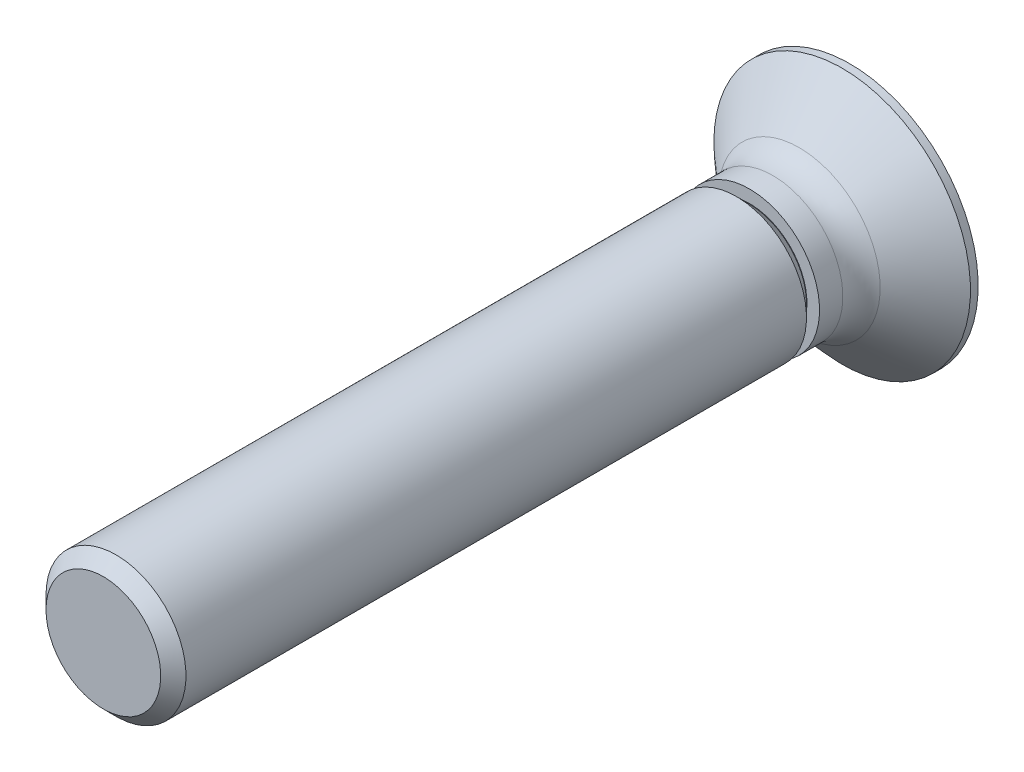
ISO-10303-21;
HEADER;
FILE_DESCRIPTION(('STEP AP214'),'2;1');
FILE_NAME('part.step','',(''),(''),'','','');
FILE_SCHEMA(('AUTOMOTIVE_DESIGN { 1 0 10303 214 1 1 1 1 }'));
ENDSEC;
DATA;
#1=APPLICATION_CONTEXT('core data for automotive mechanical design processes');
#2=APPLICATION_PROTOCOL_DEFINITION('international standard','automotive_design',2000,#1);
#3=PRODUCT_CONTEXT('',#1,'mechanical');
#4=PRODUCT('Part','Part','',(#3));
#5=PRODUCT_RELATED_PRODUCT_CATEGORY('part','',(#4));
#6=PRODUCT_DEFINITION_FORMATION('','',#4);
#7=PRODUCT_DEFINITION_CONTEXT('part definition',#1,'design');
#8=PRODUCT_DEFINITION('design','',#6,#7);
#9=PRODUCT_DEFINITION_SHAPE('','',#8);
#10=(LENGTH_UNIT() NAMED_UNIT(*) SI_UNIT(.MILLI.,.METRE.));
#11=(NAMED_UNIT(*) PLANE_ANGLE_UNIT() SI_UNIT($,.RADIAN.));
#12=(NAMED_UNIT(*) SI_UNIT($,.STERADIAN.) SOLID_ANGLE_UNIT());
#13=UNCERTAINTY_MEASURE_WITH_UNIT(LENGTH_MEASURE(1.E-05),#10,'distance_accuracy_value','');
#14=(GEOMETRIC_REPRESENTATION_CONTEXT(3) GLOBAL_UNCERTAINTY_ASSIGNED_CONTEXT((#13)) GLOBAL_UNIT_ASSIGNED_CONTEXT((#10,
#11,#12)) REPRESENTATION_CONTEXT('',''));
#15=CARTESIAN_POINT('',(0.,0.,0.));
#16=DIRECTION('',(0.,0.,1.));
#17=DIRECTION('',(1.,0.,0.));
#18=AXIS2_PLACEMENT_3D('',#15,#16,#17);
#19=CARTESIAN_POINT('',(0.,2.75,0.));
#20=DIRECTION('',(0.,0.,1.));
#21=DIRECTION('',(1.,0.,0.));
#22=AXIS2_PLACEMENT_3D('',#19,#20,#21);
#23=PLANE('',#22);
#24=CARTESIAN_POINT('',(0.,0.,0.));
#25=DIRECTION('',(0.,0.,-1.));
#26=DIRECTION('',(-1.,0.,0.));
#27=AXIS2_PLACEMENT_3D('',#24,#25,#26);
#28=CIRCLE('',#27,2.75);
#29=CARTESIAN_POINT('',(-2.75,0.,0.));
#30=VERTEX_POINT('',#29);
#31=EDGE_CURVE('E236',#30,#30,#28,.T.);
#32=ORIENTED_EDGE('',*,*,#31,.T.);
#33=EDGE_LOOP('',(#32));
#34=FACE_BOUND('',#33,.T.);
#35=DIRECTION('',(0.422618261740699,0.90630778703665,0.));
#36=VECTOR('',#35,1.);
#37=CARTESIAN_POINT('',(0.266666666666666,-1.6,0.));
#38=LINE('',#37,#36);
#39=CARTESIAN_POINT('',(0.266666666666666,-1.6,0.));
#40=VERTEX_POINT('',#39);
#41=CARTESIAN_POINT('',(0.690686510489199,-0.690686510489199,0.));
#42=VERTEX_POINT('',#41);
#43=EDGE_CURVE('E31',#40,#42,#38,.T.);
#44=ORIENTED_EDGE('',*,*,#43,.T.);
#45=DIRECTION('',(0.90630778703665,0.422618261740699,0.));
#46=VECTOR('',#45,1.);
#47=CARTESIAN_POINT('',(0.690686510489199,-0.690686510489199,0.));
#48=LINE('',#47,#46);
#49=CARTESIAN_POINT('',(1.6,-0.266666666666667,0.));
#50=VERTEX_POINT('',#49);
#51=EDGE_CURVE('E162',#42,#50,#48,.T.);
#52=ORIENTED_EDGE('',*,*,#51,.T.);
#53=DIRECTION('',(0.,1.,0.));
#54=VECTOR('',#53,1.);
#55=CARTESIAN_POINT('',(1.6,-0.266666666666667,0.));
#56=LINE('',#55,#54);
#57=CARTESIAN_POINT('',(1.6,0.266666666666666,0.));
#58=VERTEX_POINT('',#57);
#59=EDGE_CURVE('E158',#50,#58,#56,.T.);
#60=ORIENTED_EDGE('',*,*,#59,.T.);
#61=DIRECTION('',(-0.90630778703665,0.422618261740699,0.));
#62=VECTOR('',#61,1.);
#63=CARTESIAN_POINT('',(1.6,0.266666666666666,0.));
#64=LINE('',#63,#62);
#65=CARTESIAN_POINT('',(0.690686510489199,0.690686510489198,0.));
#66=VERTEX_POINT('',#65);
#67=EDGE_CURVE('E154',#58,#66,#64,.T.);
#68=ORIENTED_EDGE('',*,*,#67,.T.);
#69=DIRECTION('',(-0.422618261740699,0.90630778703665,0.));
#70=VECTOR('',#69,1.);
#71=CARTESIAN_POINT('',(0.690686510489199,0.690686510489198,0.));
#72=LINE('',#71,#70);
#73=CARTESIAN_POINT('',(0.266666666666667,1.6,0.));
#74=VERTEX_POINT('',#73);
#75=EDGE_CURVE('E150',#66,#74,#72,.T.);
#76=ORIENTED_EDGE('',*,*,#75,.T.);
#77=DIRECTION('',(-1.,0.,0.));
#78=VECTOR('',#77,1.);
#79=CARTESIAN_POINT('',(0.266666666666667,1.6,0.));
#80=LINE('',#79,#78);
#81=CARTESIAN_POINT('',(-0.266666666666666,1.6,0.));
#82=VERTEX_POINT('',#81);
#83=EDGE_CURVE('E146',#74,#82,#80,.T.);
#84=ORIENTED_EDGE('',*,*,#83,.T.);
#85=DIRECTION('',(-0.422618261740699,-0.90630778703665,0.));
#86=VECTOR('',#85,1.);
#87=CARTESIAN_POINT('',(-0.266666666666666,1.6,0.));
#88=LINE('',#87,#86);
#89=CARTESIAN_POINT('',(-0.690686510489197,0.690686510489199,0.));
#90=VERTEX_POINT('',#89);
#91=EDGE_CURVE('E142',#82,#90,#88,.T.);
#92=ORIENTED_EDGE('',*,*,#91,.T.);
#93=DIRECTION('',(-0.90630778703665,-0.422618261740699,0.));
#94=VECTOR('',#93,1.);
#95=CARTESIAN_POINT('',(-0.690686510489197,0.690686510489199,0.));
#96=LINE('',#95,#94);
#97=CARTESIAN_POINT('',(-1.6,0.266666666666667,0.));
#98=VERTEX_POINT('',#97);
#99=EDGE_CURVE('E138',#90,#98,#96,.T.);
#100=ORIENTED_EDGE('',*,*,#99,.T.);
#101=DIRECTION('',(0.,-1.,0.));
#102=VECTOR('',#101,1.);
#103=CARTESIAN_POINT('',(-1.6,0.266666666666667,0.));
#104=LINE('',#103,#102);
#105=CARTESIAN_POINT('',(-1.6,-0.266666666666666,0.));
#106=VERTEX_POINT('',#105);
#107=EDGE_CURVE('E133',#98,#106,#104,.T.);
#108=ORIENTED_EDGE('',*,*,#107,.T.);
#109=DIRECTION('',(0.90630778703665,-0.422618261740699,0.));
#110=VECTOR('',#109,1.);
#111=CARTESIAN_POINT('',(-1.6,-0.266666666666666,0.));
#112=LINE('',#111,#110);
#113=CARTESIAN_POINT('',(-0.690686510489199,-0.690686510489198,0.));
#114=VERTEX_POINT('',#113);
#115=EDGE_CURVE('E127',#106,#114,#112,.T.);
#116=ORIENTED_EDGE('',*,*,#115,.T.);
#117=DIRECTION('',(0.4226182617407,-0.90630778703665,0.));
#118=VECTOR('',#117,1.);
#119=CARTESIAN_POINT('',(-0.690686510489199,-0.690686510489198,0.));
#120=LINE('',#119,#118);
#121=CARTESIAN_POINT('',(-0.266666666666666,-1.6,0.));
#122=VERTEX_POINT('',#121);
#123=EDGE_CURVE('E110',#114,#122,#120,.T.);
#124=ORIENTED_EDGE('',*,*,#123,.T.);
#125=DIRECTION('',(1.,0.,0.));
#126=VECTOR('',#125,1.);
#127=CARTESIAN_POINT('',(-0.266666666666666,-1.6,0.));
#128=LINE('',#127,#126);
#129=EDGE_CURVE('E119',#122,#40,#128,.T.);
#130=ORIENTED_EDGE('',*,*,#129,.T.);
#131=EDGE_LOOP('',(#44,#52,#60,#68,#76,#84,#92,#100,#108,#116,#124,#130));
#132=FACE_BOUND('',#131,.T.);
#133=ADVANCED_FACE('F15',(#34,#132),#23,.F.);
#134=CARTESIAN_POINT('',(0.,0.,16.));
#135=DIRECTION('',(0.,0.,-1.));
#136=DIRECTION('',(-1.,0.,0.));
#137=AXIS2_PLACEMENT_3D('',#134,#135,#136);
#138=PLANE('',#137);
#139=CARTESIAN_POINT('',(0.,0.,16.));
#140=DIRECTION('',(0.,0.,-1.));
#141=DIRECTION('',(-1.,0.,0.));
#142=AXIS2_PLACEMENT_3D('',#139,#140,#141);
#143=CIRCLE('',#142,1.229375);
#144=CARTESIAN_POINT('',(-1.229375,0.,16.));
#145=VERTEX_POINT('',#144);
#146=EDGE_CURVE('E10',#145,#145,#143,.T.);
#147=ORIENTED_EDGE('',*,*,#146,.F.);
#148=EDGE_LOOP('',(#147));
#149=FACE_BOUND('',#148,.T.);
#150=ADVANCED_FACE('F17',(#149),#138,.F.);
#151=CARTESIAN_POINT('',(0.,0.,16.));
#152=DIRECTION('',(0.,0.,-1.));
#153=DIRECTION('',(-1.,0.,0.));
#154=AXIS2_PLACEMENT_3D('',#151,#152,#153);
#155=CONICAL_SURFACE('',#154,1.229375,0.785398163397449);
#156=CARTESIAN_POINT('',(0.,0.,15.729375));
#157=DIRECTION('',(0.,0.,-1.));
#158=DIRECTION('',(-1.,0.,0.));
#159=AXIS2_PLACEMENT_3D('',#156,#157,#158);
#160=CIRCLE('',#159,1.5);
#161=CARTESIAN_POINT('',(-1.5,0.,15.729375));
#162=VERTEX_POINT('',#161);
#163=EDGE_CURVE('E24',#162,#162,#160,.T.);
#164=ORIENTED_EDGE('',*,*,#163,.F.);
#165=EDGE_LOOP('',(#164));
#166=FACE_BOUND('',#165,.T.);
#167=ORIENTED_EDGE('',*,*,#146,.T.);
#168=EDGE_LOOP('',(#167));
#169=FACE_BOUND('',#168,.T.);
#170=ADVANCED_FACE('F276',(#166,#169),#155,.T.);
#171=CARTESIAN_POINT('',(0.,0.,0.));
#172=DIRECTION('',(0.,0.,-1.));
#173=DIRECTION('',(-1.,0.,0.));
#174=AXIS2_PLACEMENT_3D('',#171,#172,#173);
#175=CYLINDRICAL_SURFACE('',#174,1.5);
#176=CARTESIAN_POINT('',(0.,0.,2.430625));
#177=DIRECTION('',(0.,0.,-1.));
#178=DIRECTION('',(-1.,0.,0.));
#179=AXIS2_PLACEMENT_3D('',#176,#177,#178);
#180=CIRCLE('',#179,1.5);
#181=CARTESIAN_POINT('',(-1.5,0.,2.430625));
#182=VERTEX_POINT('',#181);
#183=EDGE_CURVE('E264',#182,#182,#180,.T.);
#184=ORIENTED_EDGE('',*,*,#183,.F.);
#185=EDGE_LOOP('',(#184));
#186=FACE_BOUND('',#185,.T.);
#187=ORIENTED_EDGE('',*,*,#163,.T.);
#188=EDGE_LOOP('',(#187));
#189=FACE_BOUND('',#188,.T.);
#190=ADVANCED_FACE('F274',(#186,#189),#175,.T.);
#191=CARTESIAN_POINT('',(0.,0.,2.430625));
#192=DIRECTION('',(0.,0.,1.));
#193=DIRECTION('',(1.,0.,0.));
#194=AXIS2_PLACEMENT_3D('',#191,#192,#193);
#195=CONICAL_SURFACE('',#194,1.5,0.785398163397448);
#196=CARTESIAN_POINT('',(0.,0.,2.16));
#197=DIRECTION('',(0.,0.,-1.));
#198=DIRECTION('',(-1.,0.,0.));
#199=AXIS2_PLACEMENT_3D('',#196,#197,#198);
#200=CIRCLE('',#199,1.229375);
#201=CARTESIAN_POINT('',(-1.229375,0.,2.16));
#202=VERTEX_POINT('',#201);
#203=EDGE_CURVE('E260',#202,#202,#200,.T.);
#204=ORIENTED_EDGE('',*,*,#203,.F.);
#205=EDGE_LOOP('',(#204));
#206=FACE_BOUND('',#205,.T.);
#207=ORIENTED_EDGE('',*,*,#183,.T.);
#208=EDGE_LOOP('',(#207));
#209=FACE_BOUND('',#208,.T.);
#210=ADVANCED_FACE('F317',(#206,#209),#195,.T.);
#211=CARTESIAN_POINT('',(0.,0.,0.));
#212=DIRECTION('',(0.,0.,-1.));
#213=DIRECTION('',(-1.,0.,0.));
#214=AXIS2_PLACEMENT_3D('',#211,#212,#213);
#215=CYLINDRICAL_SURFACE('',#214,1.229375);
#216=CARTESIAN_POINT('',(0.,0.,2.15));
#217=DIRECTION('',(0.,0.,-1.));
#218=DIRECTION('',(-1.,0.,0.));
#219=AXIS2_PLACEMENT_3D('',#216,#217,#218);
#220=CIRCLE('',#219,1.229375);
#221=CARTESIAN_POINT('',(-1.229375,0.,2.15));
#222=VERTEX_POINT('',#221);
#223=EDGE_CURVE('E256',#222,#222,#220,.T.);
#224=ORIENTED_EDGE('',*,*,#223,.F.);
#225=EDGE_LOOP('',(#224));
#226=FACE_BOUND('',#225,.T.);
#227=ORIENTED_EDGE('',*,*,#203,.T.);
#228=EDGE_LOOP('',(#227));
#229=FACE_BOUND('',#228,.T.);
#230=ADVANCED_FACE('F313',(#226,#229),#215,.T.);
#231=CARTESIAN_POINT('',(0.,1.229375,2.15));
#232=DIRECTION('',(0.,0.,-1.));
#233=DIRECTION('',(-1.,0.,0.));
#234=AXIS2_PLACEMENT_3D('',#231,#232,#233);
#235=PLANE('',#234);
#236=CARTESIAN_POINT('',(0.,0.,2.15));
#237=DIRECTION('',(0.,0.,-1.));
#238=DIRECTION('',(-1.,0.,0.));
#239=AXIS2_PLACEMENT_3D('',#236,#237,#238);
#240=CIRCLE('',#239,1.5);
#241=CARTESIAN_POINT('',(-1.5,0.,2.15));
#242=VERTEX_POINT('',#241);
#243=EDGE_CURVE('E252',#242,#242,#240,.T.);
#244=ORIENTED_EDGE('',*,*,#243,.F.);
#245=EDGE_LOOP('',(#244));
#246=FACE_BOUND('',#245,.T.);
#247=ORIENTED_EDGE('',*,*,#223,.T.);
#248=EDGE_LOOP('',(#247));
#249=FACE_BOUND('',#248,.T.);
#250=ADVANCED_FACE('F309',(#246,#249),#235,.F.);
#251=CARTESIAN_POINT('',(0.,0.,0.));
#252=DIRECTION('',(0.,0.,-1.));
#253=DIRECTION('',(-1.,0.,0.));
#254=AXIS2_PLACEMENT_3D('',#251,#252,#253);
#255=CYLINDRICAL_SURFACE('',#254,1.5);
#256=CARTESIAN_POINT('',(0.,0.,1.65));
#257=DIRECTION('',(0.,0.,-1.));
#258=DIRECTION('',(-1.,0.,0.));
#259=AXIS2_PLACEMENT_3D('',#256,#257,#258);
#260=CIRCLE('',#259,1.5);
#261=CARTESIAN_POINT('',(-1.5,0.,1.65));
#262=VERTEX_POINT('',#261);
#263=EDGE_CURVE('E248',#262,#262,#260,.T.);
#264=ORIENTED_EDGE('',*,*,#263,.F.);
#265=EDGE_LOOP('',(#264));
#266=FACE_BOUND('',#265,.T.);
#267=ORIENTED_EDGE('',*,*,#243,.T.);
#268=EDGE_LOOP('',(#267));
#269=FACE_BOUND('',#268,.T.);
#270=ADVANCED_FACE('F305',(#266,#269),#255,.T.);
#271=CARTESIAN_POINT('',(0.,0.,1.65));
#272=DIRECTION('',(0.,0.,-1.));
#273=DIRECTION('',(-1.,0.,0.));
#274=AXIS2_PLACEMENT_3D('',#271,#272,#273);
#275=TOROIDAL_SURFACE('',#274,2.3,0.8);
#276=ORIENTED_EDGE('',*,*,#263,.T.);
#277=EDGE_LOOP('',(#276));
#278=FACE_BOUND('',#277,.T.);
#279=CARTESIAN_POINT('',(0.,0.,1.08431457505076));
#280=DIRECTION('',(0.,0.,-1.));
#281=DIRECTION('',(-1.,0.,0.));
#282=AXIS2_PLACEMENT_3D('',#279,#280,#281);
#283=CIRCLE('',#282,1.73431457505076);
#284=CARTESIAN_POINT('',(-1.73431457505076,0.,1.08431457505076));
#285=VERTEX_POINT('',#284);
#286=EDGE_CURVE('E244',#285,#285,#283,.T.);
#287=ORIENTED_EDGE('',*,*,#286,.F.);
#288=EDGE_LOOP('',(#287));
#289=FACE_BOUND('',#288,.T.);
#290=ADVANCED_FACE('F301',(#278,#289),#275,.F.);
#291=CARTESIAN_POINT('',(0.,0.,1.08431457505076));
#292=DIRECTION('',(0.,0.,-1.));
#293=DIRECTION('',(-1.,0.,0.));
#294=AXIS2_PLACEMENT_3D('',#291,#292,#293);
#295=CONICAL_SURFACE('',#294,1.73431457505076,0.835161102643237);
#296=CARTESIAN_POINT('',(0.,0.,0.165));
#297=DIRECTION('',(0.,0.,-1.));
#298=DIRECTION('',(-1.,0.,0.));
#299=AXIS2_PLACEMENT_3D('',#296,#297,#298);
#300=CIRCLE('',#299,2.75);
#301=CARTESIAN_POINT('',(-2.75,0.,0.165));
#302=VERTEX_POINT('',#301);
#303=EDGE_CURVE('E240',#302,#302,#300,.T.);
#304=ORIENTED_EDGE('',*,*,#303,.F.);
#305=EDGE_LOOP('',(#304));
#306=FACE_BOUND('',#305,.T.);
#307=ORIENTED_EDGE('',*,*,#286,.T.);
#308=EDGE_LOOP('',(#307));
#309=FACE_BOUND('',#308,.T.);
#310=ADVANCED_FACE('F297',(#306,#309),#295,.T.);
#311=CARTESIAN_POINT('',(0.,0.,0.));
#312=DIRECTION('',(0.,0.,-1.));
#313=DIRECTION('',(-1.,0.,0.));
#314=AXIS2_PLACEMENT_3D('',#311,#312,#313);
#315=CYLINDRICAL_SURFACE('',#314,2.75);
#316=ORIENTED_EDGE('',*,*,#31,.F.);
#317=EDGE_LOOP('',(#316));
#318=FACE_BOUND('',#317,.T.);
#319=ORIENTED_EDGE('',*,*,#303,.T.);
#320=EDGE_LOOP('',(#319));
#321=FACE_BOUND('',#320,.T.);
#322=ADVANCED_FACE('F294',(#318,#321),#315,.T.);
#323=CARTESIAN_POINT('',(0.266666666666666,-1.6,0.));
#324=DIRECTION('',(-0.875426098065593,0.408217893676735,-0.258819045102521));
#325=DIRECTION('',(-0.422618261740699,-0.90630778703665,0.));
#326=AXIS2_PLACEMENT_3D('',#323,#324,#325);
#327=PLANE('',#326);
#328=DIRECTION('',(0.422618261740699,0.90630778703665,0.));
#329=VECTOR('',#328,1.);
#330=CARTESIAN_POINT('',(0.0311291837482248,-1.02727469648858,1.7));
#331=LINE('',#330,#329);
#332=CARTESIAN_POINT('',(0.,-1.09403144646646,1.7));
#333=VERTEX_POINT('',#332);
#334=CARTESIAN_POINT('',(0.347918282300735,-0.347918282300735,1.7));
#335=VERTEX_POINT('',#334);
#336=EDGE_CURVE('E123',#333,#335,#331,.T.);
#337=ORIENTED_EDGE('',*,*,#336,.T.);
#338=DIRECTION('',(0.193899607686987,-0.193899607686987,-0.961668281829896));
#339=VECTOR('',#338,1.);
#340=CARTESIAN_POINT('',(0.708932123765797,-0.708932123765797,-0.0904913000080147));
#341=LINE('',#340,#339);
#342=EDGE_CURVE('E197',#335,#42,#341,.T.);
#343=ORIENTED_EDGE('',*,*,#342,.T.);
#344=ORIENTED_EDGE('',*,*,#43,.F.);
#345=DIRECTION('',(0.162689201767992,-0.255370893567974,-0.953057149569945));
#346=VECTOR('',#345,1.);
#347=CARTESIAN_POINT('',(0.266666666666666,-1.6,0.));
#348=LINE('',#347,#346);
#349=CARTESIAN_POINT('',(0.,-1.18141717943534,1.56217235352282));
#350=VERTEX_POINT('',#349);
#351=EDGE_CURVE('E116',#350,#40,#348,.T.);
#352=ORIENTED_EDGE('',*,*,#351,.F.);
#353=DIRECTION('',(0.,-0.535467009821226,-0.844556144606808));
#354=VECTOR('',#353,1.);
#355=CARTESIAN_POINT('',(0.,-2.00789955953988,0.25861721431901));
#356=LINE('',#355,#354);
#357=EDGE_CURVE('E37',#333,#350,#356,.T.);
#358=ORIENTED_EDGE('',*,*,#357,.F.);
#359=EDGE_LOOP('',(#337,#343,#344,#352,#358));
#360=FACE_BOUND('',#359,.T.);
#361=ADVANCED_FACE('F292',(#360),#327,.T.);
#362=CARTESIAN_POINT('',(0.690686510489199,-0.690686510489199,0.));
#363=DIRECTION('',(-0.408217893676735,0.875426098065593,-0.258819045102521));
#364=DIRECTION('',(-0.90630778703665,-0.422618261740699,0.));
#365=AXIS2_PLACEMENT_3D('',#362,#363,#364);
#366=PLANE('',#365);
#367=DIRECTION('',(0.535467009821226,0.,-0.844556144606808));
#368=VECTOR('',#367,1.);
#369=CARTESIAN_POINT('',(2.00789955953988,0.,0.25861721431901));
#370=LINE('',#369,#368);
#371=CARTESIAN_POINT('',(1.09403144646646,0.,1.7));
#372=VERTEX_POINT('',#371);
#373=CARTESIAN_POINT('',(1.18141717943534,0.,1.56217235352282));
#374=VERTEX_POINT('',#373);
#375=EDGE_CURVE('E227',#372,#374,#370,.T.);
#376=ORIENTED_EDGE('',*,*,#375,.T.);
#377=DIRECTION('',(0.255370893567974,-0.162689201767992,-0.953057149569945));
#378=VECTOR('',#377,1.);
#379=CARTESIAN_POINT('',(1.6,-0.266666666666667,0.));
#380=LINE('',#379,#378);
#381=EDGE_CURVE('E194',#374,#50,#380,.T.);
#382=ORIENTED_EDGE('',*,*,#381,.T.);
#383=ORIENTED_EDGE('',*,*,#51,.F.);
#384=ORIENTED_EDGE('',*,*,#342,.F.);
#385=DIRECTION('',(0.90630778703665,0.422618261740699,0.));
#386=VECTOR('',#385,1.);
#387=CARTESIAN_POINT('',(0.0928666510036984,-0.466850811199468,1.7));
#388=LINE('',#387,#386);
#389=EDGE_CURVE('E202',#335,#372,#388,.T.);
#390=ORIENTED_EDGE('',*,*,#389,.T.);
#391=EDGE_LOOP('',(#376,#382,#383,#384,#390));
#392=FACE_BOUND('',#391,.T.);
#393=ADVANCED_FACE('F366',(#392),#366,.T.);
#394=CARTESIAN_POINT('',(1.6,-0.266666666666667,0.));
#395=DIRECTION('',(-0.965925826289068,0.,-0.258819045102521));
#396=DIRECTION('',(-0.258819045102521,0.,0.965925826289068));
#397=AXIS2_PLACEMENT_3D('',#394,#395,#396);
#398=PLANE('',#397);
#399=ORIENTED_EDGE('',*,*,#59,.F.);
#400=ORIENTED_EDGE('',*,*,#381,.F.);
#401=DIRECTION('',(0.255370893567974,0.162689201767992,-0.953057149569945));
#402=VECTOR('',#401,1.);
#403=CARTESIAN_POINT('',(1.6,0.266666666666666,0.));
#404=LINE('',#403,#402);
#405=EDGE_CURVE('E191',#374,#58,#404,.T.);
#406=ORIENTED_EDGE('',*,*,#405,.T.);
#407=EDGE_LOOP('',(#399,#400,#406));
#408=FACE_BOUND('',#407,.T.);
#409=ADVANCED_FACE('F372',(#408),#398,.T.);
#410=CARTESIAN_POINT('',(1.6,0.266666666666666,0.));
#411=DIRECTION('',(-0.408217893676735,-0.875426098065593,-0.258819045102521));
#412=DIRECTION('',(0.90630778703665,-0.422618261740699,0.));
#413=AXIS2_PLACEMENT_3D('',#410,#411,#412);
#414=PLANE('',#413);
#415=DIRECTION('',(-0.90630778703665,0.422618261740699,0.));
#416=VECTOR('',#415,1.);
#417=CARTESIAN_POINT('',(1.02727469648858,0.0311291837482241,1.7));
#418=LINE('',#417,#416);
#419=CARTESIAN_POINT('',(0.347918282300735,0.347918282300735,1.7));
#420=VERTEX_POINT('',#419);
#421=EDGE_CURVE('E206',#372,#420,#418,.T.);
#422=ORIENTED_EDGE('',*,*,#421,.T.);
#423=DIRECTION('',(0.193899607686987,0.193899607686987,-0.961668281829896));
#424=VECTOR('',#423,1.);
#425=CARTESIAN_POINT('',(0.708932123765798,0.708932123765797,-0.0904913000080147));
#426=LINE('',#425,#424);
#427=EDGE_CURVE('E188',#420,#66,#426,.T.);
#428=ORIENTED_EDGE('',*,*,#427,.T.);
#429=ORIENTED_EDGE('',*,*,#67,.F.);
#430=ORIENTED_EDGE('',*,*,#405,.F.);
#431=ORIENTED_EDGE('',*,*,#375,.F.);
#432=EDGE_LOOP('',(#422,#428,#429,#430,#431));
#433=FACE_BOUND('',#432,.T.);
#434=ADVANCED_FACE('F379',(#433),#414,.T.);
#435=CARTESIAN_POINT('',(0.690686510489199,0.690686510489198,0.));
#436=DIRECTION('',(-0.875426098065593,-0.408217893676735,-0.258819045102521));
#437=DIRECTION('',(0.422618261740699,-0.90630778703665,0.));
#438=AXIS2_PLACEMENT_3D('',#435,#436,#437);
#439=PLANE('',#438);
#440=DIRECTION('',(0.,0.535467009821226,-0.844556144606808));
#441=VECTOR('',#440,1.);
#442=CARTESIAN_POINT('',(0.,2.00789955953988,0.25861721431901));
#443=LINE('',#442,#441);
#444=CARTESIAN_POINT('',(0.,1.09403144646646,1.7));
#445=VERTEX_POINT('',#444);
#446=CARTESIAN_POINT('',(0.,1.18141717943534,1.56217235352282));
#447=VERTEX_POINT('',#446);
#448=EDGE_CURVE('E230',#445,#447,#443,.T.);
#449=ORIENTED_EDGE('',*,*,#448,.T.);
#450=DIRECTION('',(0.162689201767992,0.255370893567974,-0.953057149569945));
#451=VECTOR('',#450,1.);
#452=CARTESIAN_POINT('',(0.266666666666667,1.6,0.));
#453=LINE('',#452,#451);
#454=EDGE_CURVE('E185',#447,#74,#453,.T.);
#455=ORIENTED_EDGE('',*,*,#454,.T.);
#456=ORIENTED_EDGE('',*,*,#75,.F.);
#457=ORIENTED_EDGE('',*,*,#427,.F.);
#458=DIRECTION('',(-0.422618261740699,0.90630778703665,0.));
#459=VECTOR('',#458,1.);
#460=CARTESIAN_POINT('',(0.965537229233103,-0.976569823633555,1.7));
#461=LINE('',#460,#459);
#462=EDGE_CURVE('E209',#420,#445,#461,.T.);
#463=ORIENTED_EDGE('',*,*,#462,.T.);
#464=EDGE_LOOP('',(#449,#455,#456,#457,#463));
#465=FACE_BOUND('',#464,.T.);
#466=ADVANCED_FACE('F387',(#465),#439,.T.);
#467=CARTESIAN_POINT('',(0.266666666666667,1.6,0.));
#468=DIRECTION('',(0.,-0.965925826289068,-0.258819045102521));
#469=DIRECTION('',(0.,0.258819045102521,-0.965925826289068));
#470=AXIS2_PLACEMENT_3D('',#467,#468,#469);
#471=PLANE('',#470);
#472=ORIENTED_EDGE('',*,*,#83,.F.);
#473=ORIENTED_EDGE('',*,*,#454,.F.);
#474=DIRECTION('',(-0.162689201767992,0.255370893567974,-0.953057149569945));
#475=VECTOR('',#474,1.);
#476=CARTESIAN_POINT('',(-0.266666666666666,1.6,0.));
#477=LINE('',#476,#475);
#478=EDGE_CURVE('E182',#447,#82,#477,.T.);
#479=ORIENTED_EDGE('',*,*,#478,.T.);
#480=EDGE_LOOP('',(#472,#473,#479));
#481=FACE_BOUND('',#480,.T.);
#482=ADVANCED_FACE('F395',(#481),#471,.T.);
#483=CARTESIAN_POINT('',(-0.266666666666666,1.6,0.));
#484=DIRECTION('',(0.875426098065593,-0.408217893676735,-0.258819045102521));
#485=DIRECTION('',(0.422618261740699,0.90630778703665,0.));
#486=AXIS2_PLACEMENT_3D('',#483,#484,#485);
#487=PLANE('',#486);
#488=DIRECTION('',(-0.422618261740699,-0.90630778703665,0.));
#489=VECTOR('',#488,1.);
#490=CARTESIAN_POINT('',(-0.806947526414821,-0.636473108418201,1.7));
#491=LINE('',#490,#489);
#492=CARTESIAN_POINT('',(-0.347918282300733,0.347918282300735,1.7));
#493=VERTEX_POINT('',#492);
#494=EDGE_CURVE('E213',#445,#493,#491,.T.);
#495=ORIENTED_EDGE('',*,*,#494,.T.);
#496=DIRECTION('',(-0.193899607686987,0.193899607686987,-0.961668281829896));
#497=VECTOR('',#496,1.);
#498=CARTESIAN_POINT('',(-0.708932123765796,0.708932123765798,-0.0904913000080149));
#499=LINE('',#498,#497);
#500=EDGE_CURVE('E179',#493,#90,#499,.T.);
#501=ORIENTED_EDGE('',*,*,#500,.T.);
#502=ORIENTED_EDGE('',*,*,#91,.F.);
#503=ORIENTED_EDGE('',*,*,#478,.F.);
#504=ORIENTED_EDGE('',*,*,#448,.F.);
#505=EDGE_LOOP('',(#495,#501,#502,#503,#504));
#506=FACE_BOUND('',#505,.T.);
#507=ADVANCED_FACE('F403',(#506),#487,.T.);
#508=CARTESIAN_POINT('',(-0.690686510489197,0.690686510489199,0.));
#509=DIRECTION('',(0.408217893676735,-0.875426098065593,-0.258819045102521));
#510=DIRECTION('',(0.90630778703665,0.422618261740699,0.));
#511=AXIS2_PLACEMENT_3D('',#508,#509,#510);
#512=PLANE('',#511);
#513=DIRECTION('',(-0.535467009821226,0.,-0.844556144606808));
#514=VECTOR('',#513,1.);
#515=CARTESIAN_POINT('',(-2.00789955953988,0.,0.25861721431901));
#516=LINE('',#515,#514);
#517=CARTESIAN_POINT('',(-1.09403144646646,0.,1.7));
#518=VERTEX_POINT('',#517);
#519=CARTESIAN_POINT('',(-1.18141717943534,0.,1.56217235352282));
#520=VERTEX_POINT('',#519);
#521=EDGE_CURVE('E233',#518,#520,#516,.T.);
#522=ORIENTED_EDGE('',*,*,#521,.T.);
#523=DIRECTION('',(-0.255370893567974,0.162689201767992,-0.953057149569945));
#524=VECTOR('',#523,1.);
#525=CARTESIAN_POINT('',(-1.6,0.266666666666667,0.));
#526=LINE('',#525,#524);
#527=EDGE_CURVE('E176',#520,#98,#526,.T.);
#528=ORIENTED_EDGE('',*,*,#527,.T.);
#529=ORIENTED_EDGE('',*,*,#99,.F.);
#530=ORIENTED_EDGE('',*,*,#500,.F.);
#531=DIRECTION('',(-0.90630778703665,-0.422618261740699,0.));
#532=VECTOR('',#531,1.);
#533=CARTESIAN_POINT('',(-0.297934937066678,0.37122589896358,1.7));
#534=LINE('',#533,#532);
#535=EDGE_CURVE('E216',#493,#518,#534,.T.);
#536=ORIENTED_EDGE('',*,*,#535,.T.);
#537=EDGE_LOOP('',(#522,#528,#529,#530,#536));
#538=FACE_BOUND('',#537,.T.);
#539=ADVANCED_FACE('F411',(#538),#512,.T.);
#540=CARTESIAN_POINT('',(-1.6,0.266666666666667,0.));
#541=DIRECTION('',(0.965925826289068,0.,-0.258819045102521));
#542=DIRECTION('',(-0.258819045102521,0.,-0.965925826289068));
#543=AXIS2_PLACEMENT_3D('',#540,#541,#542);
#544=PLANE('',#543);
#545=ORIENTED_EDGE('',*,*,#107,.F.);
#546=ORIENTED_EDGE('',*,*,#527,.F.);
#547=DIRECTION('',(-0.255370893567974,-0.162689201767992,-0.953057149569945));
#548=VECTOR('',#547,1.);
#549=CARTESIAN_POINT('',(-1.6,-0.266666666666666,0.));
#550=LINE('',#549,#548);
#551=EDGE_CURVE('E173',#520,#106,#550,.T.);
#552=ORIENTED_EDGE('',*,*,#551,.T.);
#553=EDGE_LOOP('',(#545,#546,#552));
#554=FACE_BOUND('',#553,.T.);
#555=ADVANCED_FACE('F419',(#554),#544,.T.);
#556=CARTESIAN_POINT('',(-1.6,-0.266666666666666,0.));
#557=DIRECTION('',(0.408217893676735,0.875426098065593,-0.258819045102521));
#558=DIRECTION('',(-0.90630778703665,0.422618261740699,0.));
#559=AXIS2_PLACEMENT_3D('',#556,#557,#558);
#560=PLANE('',#559);
#561=DIRECTION('',(0.90630778703665,-0.422618261740699,0.));
#562=VECTOR('',#561,1.);
#563=CARTESIAN_POINT('',(0.6364731084182,-0.806947526414823,1.7));
#564=LINE('',#563,#562);
#565=CARTESIAN_POINT('',(-0.347918282300735,-0.347918282300734,1.7));
#566=VERTEX_POINT('',#565);
#567=EDGE_CURVE('E220',#518,#566,#564,.T.);
#568=ORIENTED_EDGE('',*,*,#567,.T.);
#569=DIRECTION('',(-0.193899607686987,-0.193899607686987,-0.961668281829896));
#570=VECTOR('',#569,1.);
#571=CARTESIAN_POINT('',(-0.708932123765798,-0.708932123765797,-0.0904913000080147));
#572=LINE('',#571,#570);
#573=EDGE_CURVE('E115',#566,#114,#572,.T.);
#574=ORIENTED_EDGE('',*,*,#573,.T.);
#575=ORIENTED_EDGE('',*,*,#115,.F.);
#576=ORIENTED_EDGE('',*,*,#551,.F.);
#577=ORIENTED_EDGE('',*,*,#521,.F.);
#578=EDGE_LOOP('',(#568,#574,#575,#576,#577));
#579=FACE_BOUND('',#578,.T.);
#580=ADVANCED_FACE('F427',(#579),#560,.T.);
#581=CARTESIAN_POINT('',(-0.690686510489199,-0.690686510489198,0.));
#582=DIRECTION('',(0.875426098065593,0.408217893676735,-0.258819045102521));
#583=DIRECTION('',(-0.422618261740699,0.90630778703665,0.));
#584=AXIS2_PLACEMENT_3D('',#581,#582,#583);
#585=PLANE('',#584);
#586=ORIENTED_EDGE('',*,*,#357,.T.);
#587=DIRECTION('',(-0.162689201767992,-0.255370893567974,-0.953057149569945));
#588=VECTOR('',#587,1.);
#589=CARTESIAN_POINT('',(-0.266666666666666,-1.6,0.));
#590=LINE('',#589,#588);
#591=EDGE_CURVE('E105',#350,#122,#590,.T.);
#592=ORIENTED_EDGE('',*,*,#591,.T.);
#593=ORIENTED_EDGE('',*,*,#123,.F.);
#594=ORIENTED_EDGE('',*,*,#573,.F.);
#595=DIRECTION('',(0.422618261740699,-0.90630778703665,0.));
#596=VECTOR('',#595,1.);
#597=CARTESIAN_POINT('',(0.127460519070055,-1.36737141170393,1.7));
#598=LINE('',#597,#596);
#599=EDGE_CURVE('E169',#566,#333,#598,.T.);
#600=ORIENTED_EDGE('',*,*,#599,.T.);
#601=EDGE_LOOP('',(#586,#592,#593,#594,#600));
#602=FACE_BOUND('',#601,.T.);
#603=ADVANCED_FACE('F107',(#602),#585,.T.);
#604=CARTESIAN_POINT('',(-0.266666666666666,-1.6,0.));
#605=DIRECTION('',(0.,0.965925826289068,-0.258819045102521));
#606=DIRECTION('',(0.,0.258819045102521,0.965925826289068));
#607=AXIS2_PLACEMENT_3D('',#604,#605,#606);
#608=PLANE('',#607);
#609=ORIENTED_EDGE('',*,*,#129,.F.);
#610=ORIENTED_EDGE('',*,*,#591,.F.);
#611=ORIENTED_EDGE('',*,*,#351,.T.);
#612=EDGE_LOOP('',(#609,#610,#611));
#613=FACE_BOUND('',#612,.T.);
#614=ADVANCED_FACE('F120',(#613),#608,.T.);
#615=CARTESIAN_POINT('',(0.443964731120089,-1.21978307378669,1.7));
#616=DIRECTION('',(0.,0.,-1.));
#617=DIRECTION('',(-1.,0.,0.));
#618=AXIS2_PLACEMENT_3D('',#615,#616,#617);
#619=PLANE('',#618);
#620=ORIENTED_EDGE('',*,*,#599,.F.);
#621=ORIENTED_EDGE('',*,*,#567,.F.);
#622=ORIENTED_EDGE('',*,*,#535,.F.);
#623=ORIENTED_EDGE('',*,*,#494,.F.);
#624=ORIENTED_EDGE('',*,*,#462,.F.);
#625=ORIENTED_EDGE('',*,*,#421,.F.);
#626=ORIENTED_EDGE('',*,*,#389,.F.);
#627=ORIENTED_EDGE('',*,*,#336,.F.);
#628=EDGE_LOOP('',(#620,#621,#622,#623,#624,#625,#626,#627));
#629=FACE_BOUND('',#628,.T.);
#630=ADVANCED_FACE('F448',(#629),#619,.T.);
#631=CLOSED_SHELL('',(#133,#150,#170,#190,#210,#230,#250,#270,#290,#310,#322,#361,#393,#409,
#434,#466,#482,#507,#539,#555,#580,#603,#614,#630));
#632=MANIFOLD_SOLID_BREP('B1',#631);
#633=ADVANCED_BREP_SHAPE_REPRESENTATION('',(#18,#632),#14);
#634=SHAPE_DEFINITION_REPRESENTATION(#9,#633);
ENDSEC;
END-ISO-10303-21;
